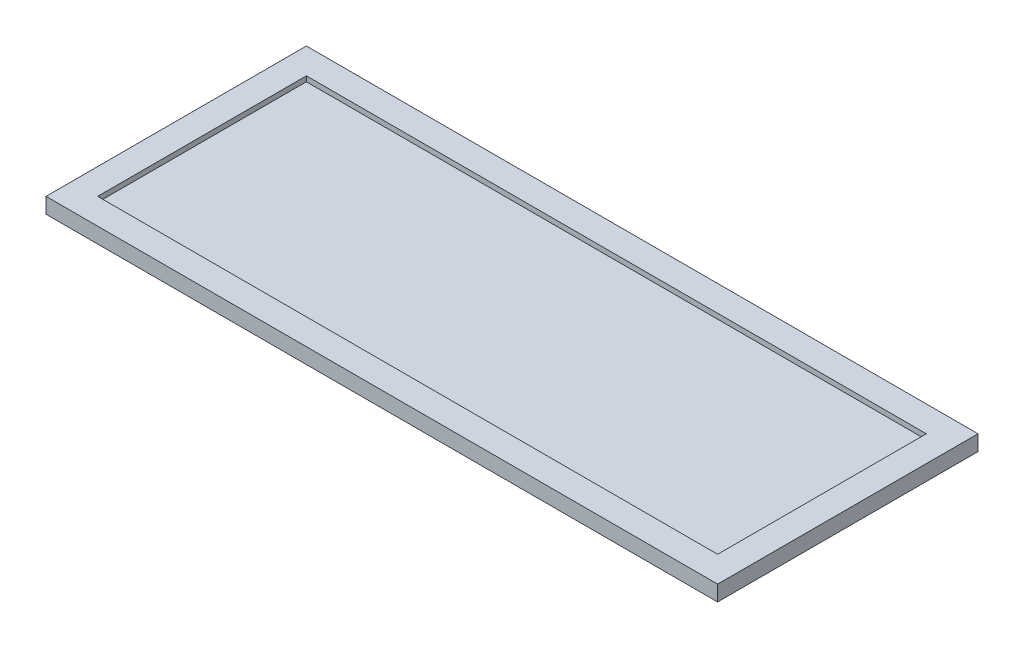
ISO-10303-21;
HEADER;
FILE_DESCRIPTION(('STEP AP214'),'2;1');
FILE_NAME('part.step','',(''),(''),'','','');
FILE_SCHEMA(('AUTOMOTIVE_DESIGN { 1 0 10303 214 1 1 1 1 }'));
ENDSEC;
DATA;
#1=APPLICATION_CONTEXT('core data for automotive mechanical design processes');
#2=APPLICATION_PROTOCOL_DEFINITION('international standard','automotive_design',2000,#1);
#3=PRODUCT_CONTEXT('',#1,'mechanical');
#4=PRODUCT('Part','Part','',(#3));
#5=PRODUCT_RELATED_PRODUCT_CATEGORY('part','',(#4));
#6=PRODUCT_DEFINITION_FORMATION('','',#4);
#7=PRODUCT_DEFINITION_CONTEXT('part definition',#1,'design');
#8=PRODUCT_DEFINITION('design','',#6,#7);
#9=PRODUCT_DEFINITION_SHAPE('','',#8);
#10=(LENGTH_UNIT() NAMED_UNIT(*) SI_UNIT(.MILLI.,.METRE.));
#11=(NAMED_UNIT(*) PLANE_ANGLE_UNIT() SI_UNIT($,.RADIAN.));
#12=(NAMED_UNIT(*) SI_UNIT($,.STERADIAN.) SOLID_ANGLE_UNIT());
#13=UNCERTAINTY_MEASURE_WITH_UNIT(LENGTH_MEASURE(1.E-05),#10,'distance_accuracy_value','');
#14=(GEOMETRIC_REPRESENTATION_CONTEXT(3) GLOBAL_UNCERTAINTY_ASSIGNED_CONTEXT((#13)) GLOBAL_UNIT_ASSIGNED_CONTEXT((#10,
#11,#12)) REPRESENTATION_CONTEXT('',''));
#15=CARTESIAN_POINT('',(0.,0.,0.));
#16=DIRECTION('',(0.,0.,1.));
#17=DIRECTION('',(1.,0.,0.));
#18=AXIS2_PLACEMENT_3D('',#15,#16,#17);
#19=CARTESIAN_POINT('',(300.,7.5,101.));
#20=DIRECTION('',(-1.,0.,0.));
#21=DIRECTION('',(0.,0.,1.));
#22=AXIS2_PLACEMENT_3D('',#19,#20,#21);
#23=PLANE('',#22);
#24=DIRECTION('',(0.,-1.,0.));
#25=VECTOR('',#24,1.);
#26=CARTESIAN_POINT('',(300.,7.5,101.));
#27=LINE('',#26,#25);
#28=CARTESIAN_POINT('',(300.,-2.5,101.));
#29=VERTEX_POINT('',#28);
#30=CARTESIAN_POINT('',(300.,-7.5,101.));
#31=VERTEX_POINT('',#30);
#32=EDGE_CURVE('E136',#29,#31,#27,.T.);
#33=ORIENTED_EDGE('',*,*,#32,.F.);
#34=DIRECTION('',(0.,0.,-1.));
#35=VECTOR('',#34,1.);
#36=CARTESIAN_POINT('',(300.,-2.5,101.));
#37=LINE('',#36,#35);
#38=CARTESIAN_POINT('',(300.,-2.5,-101.));
#39=VERTEX_POINT('',#38);
#40=EDGE_CURVE('E154',#29,#39,#37,.T.);
#41=ORIENTED_EDGE('',*,*,#40,.T.);
#42=DIRECTION('',(0.,-1.,0.));
#43=VECTOR('',#42,1.);
#44=CARTESIAN_POINT('',(300.,7.5,-101.));
#45=LINE('',#44,#43);
#46=CARTESIAN_POINT('',(300.,-7.5,-101.));
#47=VERTEX_POINT('',#46);
#48=EDGE_CURVE('E186',#39,#47,#45,.T.);
#49=ORIENTED_EDGE('',*,*,#48,.T.);
#50=DIRECTION('',(0.,0.,-1.));
#51=VECTOR('',#50,1.);
#52=CARTESIAN_POINT('',(300.,-7.5,101.));
#53=LINE('',#52,#51);
#54=EDGE_CURVE('E146',#31,#47,#53,.T.);
#55=ORIENTED_EDGE('',*,*,#54,.F.);
#56=EDGE_LOOP('',(#33,#41,#49,#55));
#57=FACE_BOUND('',#56,.T.);
#58=ADVANCED_FACE('F35',(#57),#23,.T.);
#59=CARTESIAN_POINT('',(300.,7.5,-101.));
#60=DIRECTION('',(0.,0.,1.));
#61=DIRECTION('',(1.,0.,0.));
#62=AXIS2_PLACEMENT_3D('',#59,#60,#61);
#63=PLANE('',#62);
#64=ORIENTED_EDGE('',*,*,#48,.F.);
#65=DIRECTION('',(-1.,0.,0.));
#66=VECTOR('',#65,1.);
#67=CARTESIAN_POINT('',(300.,-2.5,-101.));
#68=LINE('',#67,#66);
#69=CARTESIAN_POINT('',(-300.,-2.5,-101.));
#70=VERTEX_POINT('',#69);
#71=EDGE_CURVE('E157',#39,#70,#68,.T.);
#72=ORIENTED_EDGE('',*,*,#71,.T.);
#73=DIRECTION('',(0.,-1.,0.));
#74=VECTOR('',#73,1.);
#75=CARTESIAN_POINT('',(-300.,7.5,-101.));
#76=LINE('',#75,#74);
#77=CARTESIAN_POINT('',(-300.,-7.5,-101.));
#78=VERTEX_POINT('',#77);
#79=EDGE_CURVE('E183',#70,#78,#76,.T.);
#80=ORIENTED_EDGE('',*,*,#79,.T.);
#81=DIRECTION('',(-1.,0.,0.));
#82=VECTOR('',#81,1.);
#83=CARTESIAN_POINT('',(300.,-7.5,-101.));
#84=LINE('',#83,#82);
#85=EDGE_CURVE('E149',#47,#78,#84,.T.);
#86=ORIENTED_EDGE('',*,*,#85,.F.);
#87=EDGE_LOOP('',(#64,#72,#80,#86));
#88=FACE_BOUND('',#87,.T.);
#89=ADVANCED_FACE('F242',(#88),#63,.T.);
#90=CARTESIAN_POINT('',(-300.,7.5,101.));
#91=DIRECTION('',(1.,0.,0.));
#92=DIRECTION('',(0.,0.,-1.));
#93=AXIS2_PLACEMENT_3D('',#90,#91,#92);
#94=PLANE('',#93);
#95=ORIENTED_EDGE('',*,*,#79,.F.);
#96=DIRECTION('',(0.,0.,1.));
#97=VECTOR('',#96,1.);
#98=CARTESIAN_POINT('',(-300.,-2.5,-101.));
#99=LINE('',#98,#97);
#100=CARTESIAN_POINT('',(-300.,-2.5,101.));
#101=VERTEX_POINT('',#100);
#102=EDGE_CURVE('E160',#70,#101,#99,.T.);
#103=ORIENTED_EDGE('',*,*,#102,.T.);
#104=DIRECTION('',(0.,-1.,0.));
#105=VECTOR('',#104,1.);
#106=CARTESIAN_POINT('',(-300.,7.5,101.));
#107=LINE('',#106,#105);
#108=CARTESIAN_POINT('',(-300.,-7.5,101.));
#109=VERTEX_POINT('',#108);
#110=EDGE_CURVE('E135',#101,#109,#107,.T.);
#111=ORIENTED_EDGE('',*,*,#110,.T.);
#112=DIRECTION('',(0.,0.,1.));
#113=VECTOR('',#112,1.);
#114=CARTESIAN_POINT('',(-300.,-7.5,101.));
#115=LINE('',#114,#113);
#116=EDGE_CURVE('E176',#78,#109,#115,.T.);
#117=ORIENTED_EDGE('',*,*,#116,.F.);
#118=EDGE_LOOP('',(#95,#103,#111,#117));
#119=FACE_BOUND('',#118,.T.);
#120=ADVANCED_FACE('F248',(#119),#94,.T.);
#121=CARTESIAN_POINT('',(300.,7.5,101.));
#122=DIRECTION('',(0.,0.,-1.));
#123=DIRECTION('',(-1.,0.,0.));
#124=AXIS2_PLACEMENT_3D('',#121,#122,#123);
#125=PLANE('',#124);
#126=ORIENTED_EDGE('',*,*,#110,.F.);
#127=DIRECTION('',(1.,0.,0.));
#128=VECTOR('',#127,1.);
#129=CARTESIAN_POINT('',(-300.,-2.5,101.));
#130=LINE('',#129,#128);
#131=EDGE_CURVE('E143',#101,#29,#130,.T.);
#132=ORIENTED_EDGE('',*,*,#131,.T.);
#133=ORIENTED_EDGE('',*,*,#32,.T.);
#134=DIRECTION('',(1.,0.,0.));
#135=VECTOR('',#134,1.);
#136=CARTESIAN_POINT('',(300.,-7.5,101.));
#137=LINE('',#136,#135);
#138=EDGE_CURVE('E168',#109,#31,#137,.T.);
#139=ORIENTED_EDGE('',*,*,#138,.F.);
#140=EDGE_LOOP('',(#126,#132,#133,#139));
#141=FACE_BOUND('',#140,.T.);
#142=ADVANCED_FACE('F266',(#141),#125,.T.);
#143=CARTESIAN_POINT('',(0.,7.5,0.));
#144=DIRECTION('',(0.,1.,0.));
#145=DIRECTION('',(0.,0.,1.));
#146=AXIS2_PLACEMENT_3D('',#143,#144,#145);
#147=PLANE('',#146);
#148=DIRECTION('',(0.,0.,1.));
#149=VECTOR('',#148,1.);
#150=CARTESIAN_POINT('',(-325.,7.5,126.));
#151=LINE('',#150,#149);
#152=CARTESIAN_POINT('',(-325.,7.5,-126.));
#153=VERTEX_POINT('',#152);
#154=CARTESIAN_POINT('',(-325.,7.5,126.));
#155=VERTEX_POINT('',#154);
#156=EDGE_CURVE('E189',#153,#155,#151,.T.);
#157=ORIENTED_EDGE('',*,*,#156,.T.);
#158=DIRECTION('',(1.,0.,0.));
#159=VECTOR('',#158,1.);
#160=CARTESIAN_POINT('',(325.,7.5,126.));
#161=LINE('',#160,#159);
#162=CARTESIAN_POINT('',(325.,7.5,126.));
#163=VERTEX_POINT('',#162);
#164=EDGE_CURVE('E192',#155,#163,#161,.T.);
#165=ORIENTED_EDGE('',*,*,#164,.T.);
#166=DIRECTION('',(0.,0.,-1.));
#167=VECTOR('',#166,1.);
#168=CARTESIAN_POINT('',(325.,7.5,126.));
#169=LINE('',#168,#167);
#170=CARTESIAN_POINT('',(325.,7.5,-126.));
#171=VERTEX_POINT('',#170);
#172=EDGE_CURVE('E195',#163,#171,#169,.T.);
#173=ORIENTED_EDGE('',*,*,#172,.T.);
#174=DIRECTION('',(-1.,0.,0.));
#175=VECTOR('',#174,1.);
#176=CARTESIAN_POINT('',(325.,7.5,-126.));
#177=LINE('',#176,#175);
#178=EDGE_CURVE('E197',#171,#153,#177,.T.);
#179=ORIENTED_EDGE('',*,*,#178,.T.);
#180=EDGE_LOOP('',(#157,#165,#173,#179));
#181=FACE_BOUND('',#180,.T.);
#182=DIRECTION('',(-1.,0.,0.));
#183=VECTOR('',#182,1.);
#184=CARTESIAN_POINT('',(300.,7.5,-101.));
#185=LINE('',#184,#183);
#186=CARTESIAN_POINT('',(300.,7.5,-101.));
#187=VERTEX_POINT('',#186);
#188=CARTESIAN_POINT('',(-300.,7.5,-101.));
#189=VERTEX_POINT('',#188);
#190=EDGE_CURVE('E167',#187,#189,#185,.T.);
#191=ORIENTED_EDGE('',*,*,#190,.F.);
#192=DIRECTION('',(0.,0.,-1.));
#193=VECTOR('',#192,1.);
#194=CARTESIAN_POINT('',(300.,7.5,101.));
#195=LINE('',#194,#193);
#196=CARTESIAN_POINT('',(300.,7.5,101.));
#197=VERTEX_POINT('',#196);
#198=EDGE_CURVE('E165',#197,#187,#195,.T.);
#199=ORIENTED_EDGE('',*,*,#198,.F.);
#200=DIRECTION('',(1.,0.,0.));
#201=VECTOR('',#200,1.);
#202=CARTESIAN_POINT('',(300.,7.5,101.));
#203=LINE('',#202,#201);
#204=CARTESIAN_POINT('',(-300.,7.5,101.));
#205=VERTEX_POINT('',#204);
#206=EDGE_CURVE('E132',#205,#197,#203,.T.);
#207=ORIENTED_EDGE('',*,*,#206,.F.);
#208=DIRECTION('',(0.,0.,1.));
#209=VECTOR('',#208,1.);
#210=CARTESIAN_POINT('',(-300.,7.5,101.));
#211=LINE('',#210,#209);
#212=EDGE_CURVE('E170',#189,#205,#211,.T.);
#213=ORIENTED_EDGE('',*,*,#212,.F.);
#214=EDGE_LOOP('',(#191,#199,#207,#213));
#215=FACE_BOUND('',#214,.T.);
#216=ADVANCED_FACE('F232',(#181,#215),#147,.T.);
#217=CARTESIAN_POINT('',(0.,-7.5,0.));
#218=DIRECTION('',(0.,1.,0.));
#219=DIRECTION('',(0.,0.,1.));
#220=AXIS2_PLACEMENT_3D('',#217,#218,#219);
#221=PLANE('',#220);
#222=DIRECTION('',(0.,0.,1.));
#223=VECTOR('',#222,1.);
#224=CARTESIAN_POINT('',(-325.,-7.5,126.));
#225=LINE('',#224,#223);
#226=CARTESIAN_POINT('',(-325.,-7.5,-126.));
#227=VERTEX_POINT('',#226);
#228=CARTESIAN_POINT('',(-325.,-7.5,126.));
#229=VERTEX_POINT('',#228);
#230=EDGE_CURVE('E188',#227,#229,#225,.T.);
#231=ORIENTED_EDGE('',*,*,#230,.F.);
#232=DIRECTION('',(-1.,0.,0.));
#233=VECTOR('',#232,1.);
#234=CARTESIAN_POINT('',(325.,-7.5,-126.));
#235=LINE('',#234,#233);
#236=CARTESIAN_POINT('',(325.,-7.5,-126.));
#237=VERTEX_POINT('',#236);
#238=EDGE_CURVE('E193',#237,#227,#235,.T.);
#239=ORIENTED_EDGE('',*,*,#238,.F.);
#240=DIRECTION('',(0.,0.,-1.));
#241=VECTOR('',#240,1.);
#242=CARTESIAN_POINT('',(325.,-7.5,126.));
#243=LINE('',#242,#241);
#244=CARTESIAN_POINT('',(325.,-7.5,126.));
#245=VERTEX_POINT('',#244);
#246=EDGE_CURVE('E204',#245,#237,#243,.T.);
#247=ORIENTED_EDGE('',*,*,#246,.F.);
#248=DIRECTION('',(1.,0.,0.));
#249=VECTOR('',#248,1.);
#250=CARTESIAN_POINT('',(325.,-7.5,126.));
#251=LINE('',#250,#249);
#252=EDGE_CURVE('E202',#229,#245,#251,.T.);
#253=ORIENTED_EDGE('',*,*,#252,.F.);
#254=EDGE_LOOP('',(#231,#239,#247,#253));
#255=FACE_BOUND('',#254,.T.);
#256=ORIENTED_EDGE('',*,*,#54,.T.);
#257=ORIENTED_EDGE('',*,*,#85,.T.);
#258=ORIENTED_EDGE('',*,*,#116,.T.);
#259=ORIENTED_EDGE('',*,*,#138,.T.);
#260=EDGE_LOOP('',(#256,#257,#258,#259));
#261=FACE_BOUND('',#260,.T.);
#262=ADVANCED_FACE('F222',(#255,#261),#221,.F.);
#263=CARTESIAN_POINT('',(-325.,7.5,126.));
#264=DIRECTION('',(1.,0.,0.));
#265=DIRECTION('',(0.,0.,-1.));
#266=AXIS2_PLACEMENT_3D('',#263,#264,#265);
#267=PLANE('',#266);
#268=ORIENTED_EDGE('',*,*,#230,.T.);
#269=DIRECTION('',(0.,-1.,0.));
#270=VECTOR('',#269,1.);
#271=CARTESIAN_POINT('',(-325.,7.5,126.));
#272=LINE('',#271,#270);
#273=EDGE_CURVE('E11',#155,#229,#272,.T.);
#274=ORIENTED_EDGE('',*,*,#273,.F.);
#275=ORIENTED_EDGE('',*,*,#156,.F.);
#276=DIRECTION('',(0.,-1.,0.));
#277=VECTOR('',#276,1.);
#278=CARTESIAN_POINT('',(-325.,7.5,-126.));
#279=LINE('',#278,#277);
#280=EDGE_CURVE('E199',#153,#227,#279,.T.);
#281=ORIENTED_EDGE('',*,*,#280,.T.);
#282=EDGE_LOOP('',(#268,#274,#275,#281));
#283=FACE_BOUND('',#282,.T.);
#284=ADVANCED_FACE('F37',(#283),#267,.F.);
#285=CARTESIAN_POINT('',(325.,7.5,126.));
#286=DIRECTION('',(0.,0.,-1.));
#287=DIRECTION('',(-1.,0.,0.));
#288=AXIS2_PLACEMENT_3D('',#285,#286,#287);
#289=PLANE('',#288);
#290=ORIENTED_EDGE('',*,*,#252,.T.);
#291=DIRECTION('',(0.,-1.,0.));
#292=VECTOR('',#291,1.);
#293=CARTESIAN_POINT('',(325.,7.5,126.));
#294=LINE('',#293,#292);
#295=EDGE_CURVE('E43',#163,#245,#294,.T.);
#296=ORIENTED_EDGE('',*,*,#295,.F.);
#297=ORIENTED_EDGE('',*,*,#164,.F.);
#298=ORIENTED_EDGE('',*,*,#273,.T.);
#299=EDGE_LOOP('',(#290,#296,#297,#298));
#300=FACE_BOUND('',#299,.T.);
#301=ADVANCED_FACE('F234',(#300),#289,.F.);
#302=CARTESIAN_POINT('',(325.,7.5,126.));
#303=DIRECTION('',(-1.,0.,0.));
#304=DIRECTION('',(0.,0.,1.));
#305=AXIS2_PLACEMENT_3D('',#302,#303,#304);
#306=PLANE('',#305);
#307=ORIENTED_EDGE('',*,*,#246,.T.);
#308=DIRECTION('',(0.,-1.,0.));
#309=VECTOR('',#308,1.);
#310=CARTESIAN_POINT('',(325.,7.5,-126.));
#311=LINE('',#310,#309);
#312=EDGE_CURVE('E209',#171,#237,#311,.T.);
#313=ORIENTED_EDGE('',*,*,#312,.F.);
#314=ORIENTED_EDGE('',*,*,#172,.F.);
#315=ORIENTED_EDGE('',*,*,#295,.T.);
#316=EDGE_LOOP('',(#307,#313,#314,#315));
#317=FACE_BOUND('',#316,.T.);
#318=ADVANCED_FACE('F216',(#317),#306,.F.);
#319=CARTESIAN_POINT('',(325.,7.5,-126.));
#320=DIRECTION('',(0.,0.,1.));
#321=DIRECTION('',(1.,0.,0.));
#322=AXIS2_PLACEMENT_3D('',#319,#320,#321);
#323=PLANE('',#322);
#324=ORIENTED_EDGE('',*,*,#238,.T.);
#325=ORIENTED_EDGE('',*,*,#280,.F.);
#326=ORIENTED_EDGE('',*,*,#178,.F.);
#327=ORIENTED_EDGE('',*,*,#312,.T.);
#328=EDGE_LOOP('',(#324,#325,#326,#327));
#329=FACE_BOUND('',#328,.T.);
#330=ADVANCED_FACE('F226',(#329),#323,.F.);
#331=DIRECTION('',(0.,0.,-1.));
#332=VECTOR('',#331,1.);
#333=CARTESIAN_POINT('',(300.,2.5,101.));
#334=LINE('',#333,#332);
#335=CARTESIAN_POINT('',(300.,2.5,101.));
#336=VERTEX_POINT('',#335);
#337=CARTESIAN_POINT('',(300.,2.5,-101.));
#338=VERTEX_POINT('',#337);
#339=EDGE_CURVE('E139',#336,#338,#334,.T.);
#340=ORIENTED_EDGE('',*,*,#339,.F.);
#341=EDGE_CURVE('E126',#197,#336,#27,.T.);
#342=ORIENTED_EDGE('',*,*,#341,.F.);
#343=ORIENTED_EDGE('',*,*,#198,.T.);
#344=EDGE_CURVE('E141',#187,#338,#45,.T.);
#345=ORIENTED_EDGE('',*,*,#344,.T.);
#346=EDGE_LOOP('',(#340,#342,#343,#345));
#347=FACE_BOUND('',#346,.T.);
#348=ADVANCED_FACE('F140',(#347),#23,.T.);
#349=DIRECTION('',(-1.,0.,0.));
#350=VECTOR('',#349,1.);
#351=CARTESIAN_POINT('',(300.,2.5,-101.));
#352=LINE('',#351,#350);
#353=CARTESIAN_POINT('',(-300.,2.5,-101.));
#354=VERTEX_POINT('',#353);
#355=EDGE_CURVE('E50',#338,#354,#352,.T.);
#356=ORIENTED_EDGE('',*,*,#355,.F.);
#357=ORIENTED_EDGE('',*,*,#344,.F.);
#358=ORIENTED_EDGE('',*,*,#190,.T.);
#359=EDGE_CURVE('E184',#189,#354,#76,.T.);
#360=ORIENTED_EDGE('',*,*,#359,.T.);
#361=EDGE_LOOP('',(#356,#357,#358,#360));
#362=FACE_BOUND('',#361,.T.);
#363=ADVANCED_FACE('F251',(#362),#63,.T.);
#364=DIRECTION('',(0.,0.,1.));
#365=VECTOR('',#364,1.);
#366=CARTESIAN_POINT('',(-300.,2.5,-101.));
#367=LINE('',#366,#365);
#368=CARTESIAN_POINT('',(-300.,2.5,101.));
#369=VERTEX_POINT('',#368);
#370=EDGE_CURVE('E58',#354,#369,#367,.T.);
#371=ORIENTED_EDGE('',*,*,#370,.F.);
#372=ORIENTED_EDGE('',*,*,#359,.F.);
#373=ORIENTED_EDGE('',*,*,#212,.T.);
#374=EDGE_CURVE('E181',#205,#369,#107,.T.);
#375=ORIENTED_EDGE('',*,*,#374,.T.);
#376=EDGE_LOOP('',(#371,#372,#373,#375));
#377=FACE_BOUND('',#376,.T.);
#378=ADVANCED_FACE('F259',(#377),#94,.T.);
#379=DIRECTION('',(1.,0.,0.));
#380=VECTOR('',#379,1.);
#381=CARTESIAN_POINT('',(-300.,2.5,101.));
#382=LINE('',#381,#380);
#383=EDGE_CURVE('E130',#369,#336,#382,.T.);
#384=ORIENTED_EDGE('',*,*,#383,.F.);
#385=ORIENTED_EDGE('',*,*,#374,.F.);
#386=ORIENTED_EDGE('',*,*,#206,.T.);
#387=ORIENTED_EDGE('',*,*,#341,.T.);
#388=EDGE_LOOP('',(#384,#385,#386,#387));
#389=FACE_BOUND('',#388,.T.);
#390=ADVANCED_FACE('F128',(#389),#125,.T.);
#391=CARTESIAN_POINT('',(0.,-2.5,0.));
#392=DIRECTION('',(0.,1.,0.));
#393=DIRECTION('',(0.,0.,1.));
#394=AXIS2_PLACEMENT_3D('',#391,#392,#393);
#395=PLANE('',#394);
#396=ORIENTED_EDGE('',*,*,#40,.F.);
#397=ORIENTED_EDGE('',*,*,#131,.F.);
#398=ORIENTED_EDGE('',*,*,#102,.F.);
#399=ORIENTED_EDGE('',*,*,#71,.F.);
#400=EDGE_LOOP('',(#396,#397,#398,#399));
#401=FACE_BOUND('',#400,.T.);
#402=ADVANCED_FACE('F280',(#401),#395,.F.);
#403=CARTESIAN_POINT('',(0.,2.5,0.));
#404=DIRECTION('',(0.,1.,0.));
#405=DIRECTION('',(0.,0.,1.));
#406=AXIS2_PLACEMENT_3D('',#403,#404,#405);
#407=PLANE('',#406);
#408=ORIENTED_EDGE('',*,*,#339,.T.);
#409=ORIENTED_EDGE('',*,*,#355,.T.);
#410=ORIENTED_EDGE('',*,*,#370,.T.);
#411=ORIENTED_EDGE('',*,*,#383,.T.);
#412=EDGE_LOOP('',(#408,#409,#410,#411));
#413=FACE_BOUND('',#412,.T.);
#414=ADVANCED_FACE('F145',(#413),#407,.T.);
#415=CLOSED_SHELL('',(#58,#89,#120,#142,#216,#262,#284,#301,#318,#330,#348,#363,#378,#390,#402,#414));
#416=MANIFOLD_SOLID_BREP('B2',#415);
#417=ADVANCED_BREP_SHAPE_REPRESENTATION('',(#18,#416),#14);
#418=SHAPE_DEFINITION_REPRESENTATION(#9,#417);
ENDSEC;
END-ISO-10303-21;
